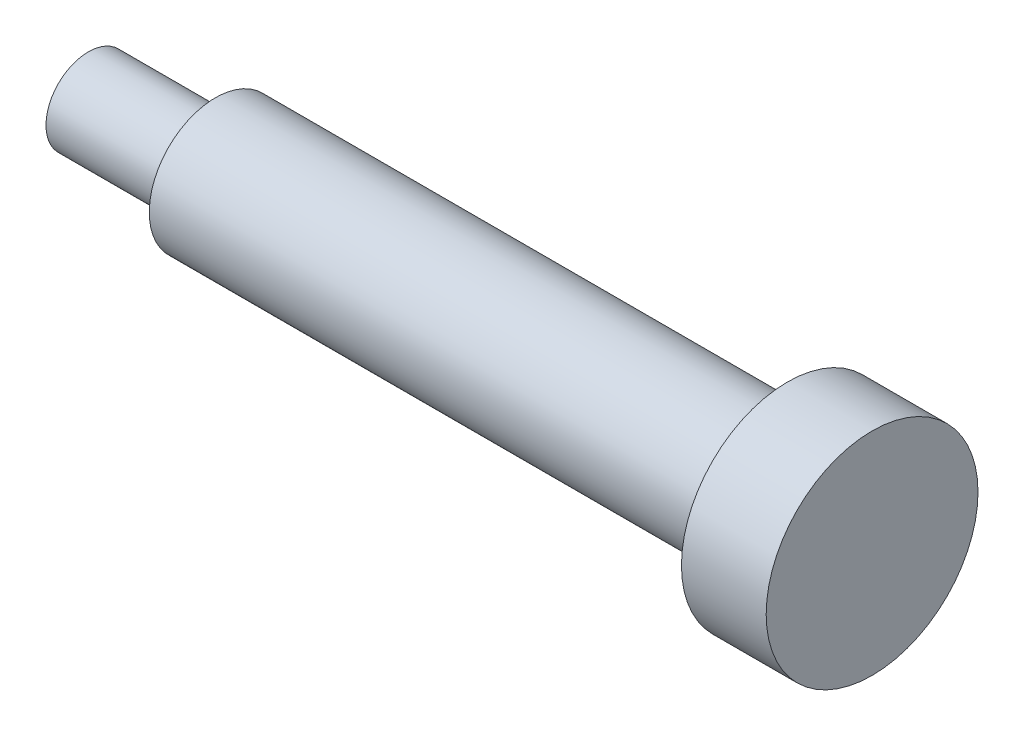
ISO-10303-21;
HEADER;
FILE_DESCRIPTION(('STEP AP214'),'2;1');
FILE_NAME('part.step','',(''),(''),'','','');
FILE_SCHEMA(('AUTOMOTIVE_DESIGN { 1 0 10303 214 1 1 1 1 }'));
ENDSEC;
DATA;
#1=APPLICATION_CONTEXT('core data for automotive mechanical design processes');
#2=APPLICATION_PROTOCOL_DEFINITION('international standard','automotive_design',2000,#1);
#3=PRODUCT_CONTEXT('',#1,'mechanical');
#4=PRODUCT('Part','Part','',(#3));
#5=PRODUCT_RELATED_PRODUCT_CATEGORY('part','',(#4));
#6=PRODUCT_DEFINITION_FORMATION('','',#4);
#7=PRODUCT_DEFINITION_CONTEXT('part definition',#1,'design');
#8=PRODUCT_DEFINITION('design','',#6,#7);
#9=PRODUCT_DEFINITION_SHAPE('','',#8);
#10=(LENGTH_UNIT() NAMED_UNIT(*) SI_UNIT(.MILLI.,.METRE.));
#11=(NAMED_UNIT(*) PLANE_ANGLE_UNIT() SI_UNIT($,.RADIAN.));
#12=(NAMED_UNIT(*) SI_UNIT($,.STERADIAN.) SOLID_ANGLE_UNIT());
#13=UNCERTAINTY_MEASURE_WITH_UNIT(LENGTH_MEASURE(1.E-05),#10,'distance_accuracy_value','');
#14=(GEOMETRIC_REPRESENTATION_CONTEXT(3) GLOBAL_UNCERTAINTY_ASSIGNED_CONTEXT((#13)) GLOBAL_UNIT_ASSIGNED_CONTEXT((#10,
#11,#12)) REPRESENTATION_CONTEXT('',''));
#15=CARTESIAN_POINT('',(0.,0.,0.));
#16=DIRECTION('',(0.,0.,1.));
#17=DIRECTION('',(1.,0.,0.));
#18=AXIS2_PLACEMENT_3D('',#15,#16,#17);
#19=CARTESIAN_POINT('',(-12.5,0.,0.));
#20=DIRECTION('',(-1.,0.,0.));
#21=DIRECTION('',(0.,-1.,0.));
#22=AXIS2_PLACEMENT_3D('',#19,#20,#21);
#23=PLANE('',#22);
#24=CARTESIAN_POINT('',(-12.5,0.,0.));
#25=DIRECTION('',(-1.,0.,0.));
#26=DIRECTION('',(0.,-1.,0.));
#27=AXIS2_PLACEMENT_3D('',#24,#25,#26);
#28=CIRCLE('',#27,3.125);
#29=CARTESIAN_POINT('',(-12.5,-3.125,0.));
#30=VERTEX_POINT('',#29);
#31=EDGE_CURVE('E53',#30,#30,#28,.T.);
#32=ORIENTED_EDGE('',*,*,#31,.T.);
#33=EDGE_LOOP('',(#32));
#34=FACE_BOUND('',#33,.T.);
#35=CARTESIAN_POINT('',(-12.5,0.,0.));
#36=DIRECTION('',(-1.,0.,0.));
#37=DIRECTION('',(0.,-1.,0.));
#38=AXIS2_PLACEMENT_3D('',#35,#36,#37);
#39=CIRCLE('',#38,2.);
#40=CARTESIAN_POINT('',(-12.5,-2.,0.));
#41=VERTEX_POINT('',#40);
#42=EDGE_CURVE('E10',#41,#41,#39,.T.);
#43=ORIENTED_EDGE('',*,*,#42,.F.);
#44=EDGE_LOOP('',(#43));
#45=FACE_BOUND('',#44,.T.);
#46=ADVANCED_FACE('F31',(#34,#45),#23,.T.);
#47=CARTESIAN_POINT('',(-18.5,0.,0.));
#48=DIRECTION('',(-1.,0.,0.));
#49=DIRECTION('',(0.,-1.,0.));
#50=AXIS2_PLACEMENT_3D('',#47,#48,#49);
#51=CYLINDRICAL_SURFACE('',#50,2.);
#52=ORIENTED_EDGE('',*,*,#42,.T.);
#53=EDGE_LOOP('',(#52));
#54=FACE_BOUND('',#53,.T.);
#55=CARTESIAN_POINT('',(-18.5,0.,0.));
#56=DIRECTION('',(-1.,0.,0.));
#57=DIRECTION('',(0.,-1.,0.));
#58=AXIS2_PLACEMENT_3D('',#55,#56,#57);
#59=CIRCLE('',#58,2.);
#60=CARTESIAN_POINT('',(-18.5,-2.,0.));
#61=VERTEX_POINT('',#60);
#62=EDGE_CURVE('E37',#61,#61,#59,.T.);
#63=ORIENTED_EDGE('',*,*,#62,.F.);
#64=EDGE_LOOP('',(#63));
#65=FACE_BOUND('',#64,.T.);
#66=ADVANCED_FACE('F71',(#54,#65),#51,.T.);
#67=CARTESIAN_POINT('',(-18.5,0.,0.));
#68=DIRECTION('',(-1.,0.,0.));
#69=DIRECTION('',(0.,-1.,0.));
#70=AXIS2_PLACEMENT_3D('',#67,#68,#69);
#71=PLANE('',#70);
#72=ORIENTED_EDGE('',*,*,#62,.T.);
#73=EDGE_LOOP('',(#72));
#74=FACE_BOUND('',#73,.T.);
#75=ADVANCED_FACE('F75',(#74),#71,.T.);
#76=CARTESIAN_POINT('',(18.5,0.,0.));
#77=DIRECTION('',(1.,0.,0.));
#78=DIRECTION('',(0.,1.,0.));
#79=AXIS2_PLACEMENT_3D('',#76,#77,#78);
#80=PLANE('',#79);
#81=CARTESIAN_POINT('',(18.5,0.,0.));
#82=DIRECTION('',(-1.,0.,0.));
#83=DIRECTION('',(0.,-1.,0.));
#84=AXIS2_PLACEMENT_3D('',#81,#82,#83);
#85=CIRCLE('',#84,5.);
#86=CARTESIAN_POINT('',(18.5,-4.99999999999999,0.));
#87=VERTEX_POINT('',#86);
#88=EDGE_CURVE('E41',#87,#87,#85,.T.);
#89=ORIENTED_EDGE('',*,*,#88,.F.);
#90=EDGE_LOOP('',(#89));
#91=FACE_BOUND('',#90,.T.);
#92=ADVANCED_FACE('F79',(#91),#80,.T.);
#93=CARTESIAN_POINT('',(-18.5,0.,0.));
#94=DIRECTION('',(-1.,0.,0.));
#95=DIRECTION('',(0.,-1.,0.));
#96=AXIS2_PLACEMENT_3D('',#93,#94,#95);
#97=CYLINDRICAL_SURFACE('',#96,5.);
#98=ORIENTED_EDGE('',*,*,#88,.T.);
#99=EDGE_LOOP('',(#98));
#100=FACE_BOUND('',#99,.T.);
#101=CARTESIAN_POINT('',(14.5,0.,0.));
#102=DIRECTION('',(-1.,0.,0.));
#103=DIRECTION('',(0.,-1.,0.));
#104=AXIS2_PLACEMENT_3D('',#101,#102,#103);
#105=CIRCLE('',#104,5.);
#106=CARTESIAN_POINT('',(14.5,-4.99999999999999,0.));
#107=VERTEX_POINT('',#106);
#108=EDGE_CURVE('E45',#107,#107,#105,.T.);
#109=ORIENTED_EDGE('',*,*,#108,.F.);
#110=EDGE_LOOP('',(#109));
#111=FACE_BOUND('',#110,.T.);
#112=ADVANCED_FACE('F67',(#100,#111),#97,.T.);
#113=CARTESIAN_POINT('',(14.5,0.,0.));
#114=DIRECTION('',(-1.,0.,0.));
#115=DIRECTION('',(0.,-1.,0.));
#116=AXIS2_PLACEMENT_3D('',#113,#114,#115);
#117=PLANE('',#116);
#118=ORIENTED_EDGE('',*,*,#108,.T.);
#119=EDGE_LOOP('',(#118));
#120=FACE_BOUND('',#119,.T.);
#121=CARTESIAN_POINT('',(14.5,0.,0.));
#122=DIRECTION('',(-1.,0.,0.));
#123=DIRECTION('',(0.,-1.,0.));
#124=AXIS2_PLACEMENT_3D('',#121,#122,#123);
#125=CIRCLE('',#124,3.125);
#126=CARTESIAN_POINT('',(14.5,-3.12499999999999,0.));
#127=VERTEX_POINT('',#126);
#128=EDGE_CURVE('E50',#127,#127,#125,.T.);
#129=ORIENTED_EDGE('',*,*,#128,.F.);
#130=EDGE_LOOP('',(#129));
#131=FACE_BOUND('',#130,.T.);
#132=ADVANCED_FACE('F61',(#120,#131),#117,.T.);
#133=CARTESIAN_POINT('',(-18.5,0.,0.));
#134=DIRECTION('',(-1.,0.,0.));
#135=DIRECTION('',(0.,-1.,0.));
#136=AXIS2_PLACEMENT_3D('',#133,#134,#135);
#137=CYLINDRICAL_SURFACE('',#136,3.125);
#138=ORIENTED_EDGE('',*,*,#128,.T.);
#139=EDGE_LOOP('',(#138));
#140=FACE_BOUND('',#139,.T.);
#141=ORIENTED_EDGE('',*,*,#31,.F.);
#142=EDGE_LOOP('',(#141));
#143=FACE_BOUND('',#142,.T.);
#144=ADVANCED_FACE('F59',(#140,#143),#137,.T.);
#145=CLOSED_SHELL('',(#46,#66,#75,#92,#112,#132,#144));
#146=MANIFOLD_SOLID_BREP('B2',#145);
#147=ADVANCED_BREP_SHAPE_REPRESENTATION('',(#18,#146),#14);
#148=SHAPE_DEFINITION_REPRESENTATION(#9,#147);
ENDSEC;
END-ISO-10303-21;
